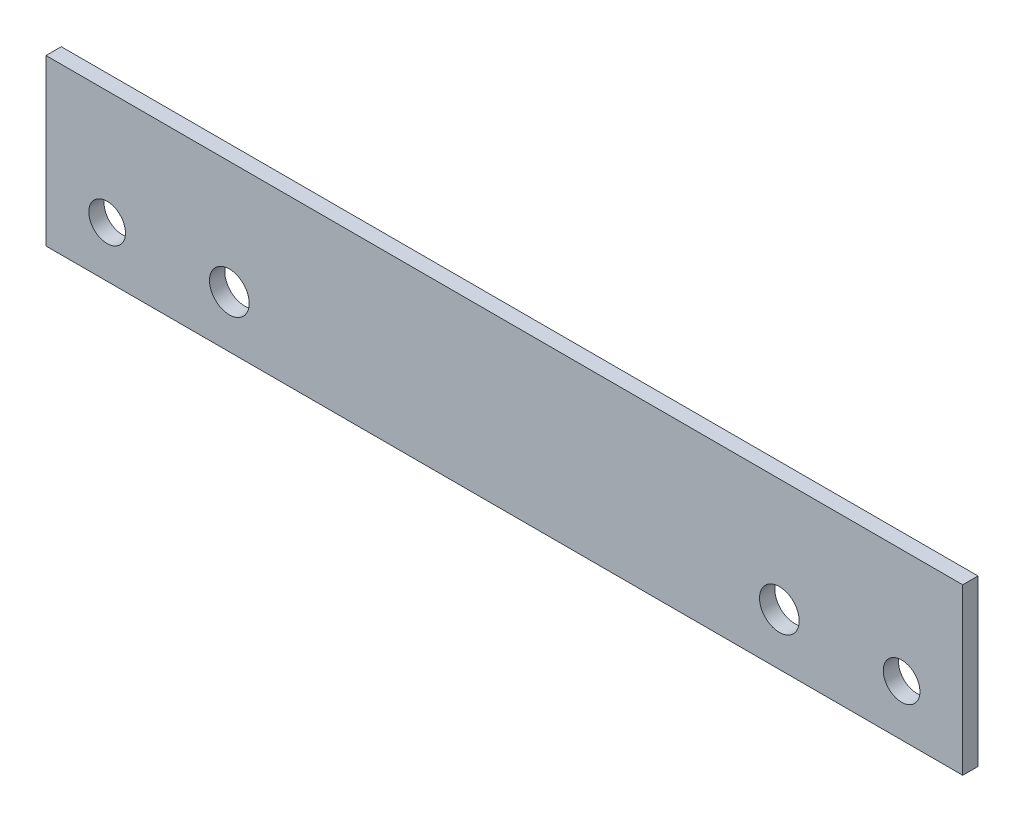
ISO-10303-21;
HEADER;
FILE_DESCRIPTION(('STEP AP214'),'2;1');
FILE_NAME('part.step','',(''),(''),'','','');
FILE_SCHEMA(('AUTOMOTIVE_DESIGN { 1 0 10303 214 1 1 1 1 }'));
ENDSEC;
DATA;
#1=APPLICATION_CONTEXT('core data for automotive mechanical design processes');
#2=APPLICATION_PROTOCOL_DEFINITION('international standard','automotive_design',2000,#1);
#3=PRODUCT_CONTEXT('',#1,'mechanical');
#4=PRODUCT('Part','Part','',(#3));
#5=PRODUCT_RELATED_PRODUCT_CATEGORY('part','',(#4));
#6=PRODUCT_DEFINITION_FORMATION('','',#4);
#7=PRODUCT_DEFINITION_CONTEXT('part definition',#1,'design');
#8=PRODUCT_DEFINITION('design','',#6,#7);
#9=PRODUCT_DEFINITION_SHAPE('','',#8);
#10=(LENGTH_UNIT() NAMED_UNIT(*) SI_UNIT(.MILLI.,.METRE.));
#11=(NAMED_UNIT(*) PLANE_ANGLE_UNIT() SI_UNIT($,.RADIAN.));
#12=(NAMED_UNIT(*) SI_UNIT($,.STERADIAN.) SOLID_ANGLE_UNIT());
#13=UNCERTAINTY_MEASURE_WITH_UNIT(LENGTH_MEASURE(1.E-05),#10,'distance_accuracy_value','');
#14=(GEOMETRIC_REPRESENTATION_CONTEXT(3) GLOBAL_UNCERTAINTY_ASSIGNED_CONTEXT((#13)) GLOBAL_UNIT_ASSIGNED_CONTEXT((#10,
#11,#12)) REPRESENTATION_CONTEXT('',''));
#15=CARTESIAN_POINT('',(0.,0.,0.));
#16=DIRECTION('',(0.,0.,1.));
#17=DIRECTION('',(1.,0.,0.));
#18=AXIS2_PLACEMENT_3D('',#15,#16,#17);
#19=CARTESIAN_POINT('',(150.,-27.,5.));
#20=DIRECTION('',(-1.,0.,0.));
#21=DIRECTION('',(0.,0.,1.));
#22=AXIS2_PLACEMENT_3D('',#19,#20,#21);
#23=PLANE('',#22);
#24=DIRECTION('',(0.,1.,0.));
#25=VECTOR('',#24,1.);
#26=CARTESIAN_POINT('',(150.,-27.,0.));
#27=LINE('',#26,#25);
#28=CARTESIAN_POINT('',(150.,-27.,0.));
#29=VERTEX_POINT('',#28);
#30=CARTESIAN_POINT('',(150.,27.,0.));
#31=VERTEX_POINT('',#30);
#32=EDGE_CURVE('E98',#29,#31,#27,.T.);
#33=ORIENTED_EDGE('',*,*,#32,.T.);
#34=DIRECTION('',(0.,0.,-1.));
#35=VECTOR('',#34,1.);
#36=CARTESIAN_POINT('',(150.,27.,5.));
#37=LINE('',#36,#35);
#38=CARTESIAN_POINT('',(150.,27.,5.));
#39=VERTEX_POINT('',#38);
#40=EDGE_CURVE('E11',#39,#31,#37,.T.);
#41=ORIENTED_EDGE('',*,*,#40,.F.);
#42=DIRECTION('',(0.,1.,0.));
#43=VECTOR('',#42,1.);
#44=CARTESIAN_POINT('',(150.,-27.,5.));
#45=LINE('',#44,#43);
#46=CARTESIAN_POINT('',(150.,-27.,5.));
#47=VERTEX_POINT('',#46);
#48=EDGE_CURVE('E86',#47,#39,#45,.T.);
#49=ORIENTED_EDGE('',*,*,#48,.F.);
#50=DIRECTION('',(0.,0.,-1.));
#51=VECTOR('',#50,1.);
#52=CARTESIAN_POINT('',(150.,-27.,5.));
#53=LINE('',#52,#51);
#54=EDGE_CURVE('E94',#47,#29,#53,.T.);
#55=ORIENTED_EDGE('',*,*,#54,.T.);
#56=EDGE_LOOP('',(#33,#41,#49,#55));
#57=FACE_BOUND('',#56,.T.);
#58=ADVANCED_FACE('F35',(#57),#23,.F.);
#59=CARTESIAN_POINT('',(-150.,27.,5.));
#60=DIRECTION('',(0.,-1.,0.));
#61=DIRECTION('',(0.,0.,-1.));
#62=AXIS2_PLACEMENT_3D('',#59,#60,#61);
#63=PLANE('',#62);
#64=DIRECTION('',(-1.,0.,0.));
#65=VECTOR('',#64,1.);
#66=CARTESIAN_POINT('',(-150.,27.,0.));
#67=LINE('',#66,#65);
#68=CARTESIAN_POINT('',(-150.,27.,0.));
#69=VERTEX_POINT('',#68);
#70=EDGE_CURVE('E90',#31,#69,#67,.T.);
#71=ORIENTED_EDGE('',*,*,#70,.T.);
#72=DIRECTION('',(0.,0.,-1.));
#73=VECTOR('',#72,1.);
#74=CARTESIAN_POINT('',(-150.,27.,5.));
#75=LINE('',#74,#73);
#76=CARTESIAN_POINT('',(-150.,27.,5.));
#77=VERTEX_POINT('',#76);
#78=EDGE_CURVE('E43',#77,#69,#75,.T.);
#79=ORIENTED_EDGE('',*,*,#78,.F.);
#80=DIRECTION('',(-1.,0.,0.));
#81=VECTOR('',#80,1.);
#82=CARTESIAN_POINT('',(-150.,27.,5.));
#83=LINE('',#82,#81);
#84=EDGE_CURVE('E81',#39,#77,#83,.T.);
#85=ORIENTED_EDGE('',*,*,#84,.F.);
#86=ORIENTED_EDGE('',*,*,#40,.T.);
#87=EDGE_LOOP('',(#71,#79,#85,#86));
#88=FACE_BOUND('',#87,.T.);
#89=ADVANCED_FACE('F89',(#88),#63,.F.);
#90=CARTESIAN_POINT('',(-150.,-27.,5.));
#91=DIRECTION('',(1.,0.,0.));
#92=DIRECTION('',(0.,0.,-1.));
#93=AXIS2_PLACEMENT_3D('',#90,#91,#92);
#94=PLANE('',#93);
#95=DIRECTION('',(0.,-1.,0.));
#96=VECTOR('',#95,1.);
#97=CARTESIAN_POINT('',(-150.,-27.,0.));
#98=LINE('',#97,#96);
#99=CARTESIAN_POINT('',(-150.,-27.,0.));
#100=VERTEX_POINT('',#99);
#101=EDGE_CURVE('E68',#69,#100,#98,.T.);
#102=ORIENTED_EDGE('',*,*,#101,.T.);
#103=DIRECTION('',(0.,0.,-1.));
#104=VECTOR('',#103,1.);
#105=CARTESIAN_POINT('',(-150.,-27.,5.));
#106=LINE('',#105,#104);
#107=CARTESIAN_POINT('',(-150.,-27.,5.));
#108=VERTEX_POINT('',#107);
#109=EDGE_CURVE('E91',#108,#100,#106,.T.);
#110=ORIENTED_EDGE('',*,*,#109,.F.);
#111=DIRECTION('',(0.,-1.,0.));
#112=VECTOR('',#111,1.);
#113=CARTESIAN_POINT('',(-150.,-27.,5.));
#114=LINE('',#113,#112);
#115=EDGE_CURVE('E84',#77,#108,#114,.T.);
#116=ORIENTED_EDGE('',*,*,#115,.F.);
#117=ORIENTED_EDGE('',*,*,#78,.T.);
#118=EDGE_LOOP('',(#102,#110,#116,#117));
#119=FACE_BOUND('',#118,.T.);
#120=ADVANCED_FACE('F92',(#119),#94,.F.);
#121=CARTESIAN_POINT('',(-150.,-27.,5.));
#122=DIRECTION('',(0.,1.,0.));
#123=DIRECTION('',(0.,0.,1.));
#124=AXIS2_PLACEMENT_3D('',#121,#122,#123);
#125=PLANE('',#124);
#126=DIRECTION('',(1.,0.,0.));
#127=VECTOR('',#126,1.);
#128=CARTESIAN_POINT('',(-150.,-27.,0.));
#129=LINE('',#128,#127);
#130=EDGE_CURVE('E74',#100,#29,#129,.T.);
#131=ORIENTED_EDGE('',*,*,#130,.T.);
#132=ORIENTED_EDGE('',*,*,#54,.F.);
#133=DIRECTION('',(1.,0.,0.));
#134=VECTOR('',#133,1.);
#135=CARTESIAN_POINT('',(-150.,-27.,5.));
#136=LINE('',#135,#134);
#137=EDGE_CURVE('E51',#108,#47,#136,.T.);
#138=ORIENTED_EDGE('',*,*,#137,.F.);
#139=ORIENTED_EDGE('',*,*,#109,.T.);
#140=EDGE_LOOP('',(#131,#132,#138,#139));
#141=FACE_BOUND('',#140,.T.);
#142=ADVANCED_FACE('F106',(#141),#125,.F.);
#143=CARTESIAN_POINT('',(0.,0.,5.));
#144=DIRECTION('',(0.,0.,-1.));
#145=DIRECTION('',(-1.,0.,0.));
#146=AXIS2_PLACEMENT_3D('',#143,#144,#145);
#147=PLANE('',#146);
#148=CARTESIAN_POINT('',(-90.,-10.,5.));
#149=DIRECTION('',(0.,0.,-1.));
#150=DIRECTION('',(-1.,0.,0.));
#151=AXIS2_PLACEMENT_3D('',#148,#149,#150);
#152=CIRCLE('',#151,6.5);
#153=CARTESIAN_POINT('',(-96.5,-10.,5.));
#154=VERTEX_POINT('',#153);
#155=EDGE_CURVE('E129',#154,#154,#152,.F.);
#156=ORIENTED_EDGE('',*,*,#155,.F.);
#157=EDGE_LOOP('',(#156));
#158=FACE_BOUND('',#157,.T.);
#159=CARTESIAN_POINT('',(90.,-10.,5.));
#160=DIRECTION('',(0.,0.,-1.));
#161=DIRECTION('',(-1.,0.,0.));
#162=AXIS2_PLACEMENT_3D('',#159,#160,#161);
#163=CIRCLE('',#162,6.5);
#164=CARTESIAN_POINT('',(83.5,-10.,5.));
#165=VERTEX_POINT('',#164);
#166=EDGE_CURVE('E121',#165,#165,#163,.T.);
#167=ORIENTED_EDGE('',*,*,#166,.T.);
#168=EDGE_LOOP('',(#167));
#169=FACE_BOUND('',#168,.T.);
#170=CARTESIAN_POINT('',(-130.,-10.3,5.));
#171=DIRECTION('',(0.,0.,1.));
#172=DIRECTION('',(1.,0.,0.));
#173=AXIS2_PLACEMENT_3D('',#170,#171,#172);
#174=CIRCLE('',#173,6.);
#175=CARTESIAN_POINT('',(-124.,-10.3,5.));
#176=VERTEX_POINT('',#175);
#177=EDGE_CURVE('E115',#176,#176,#174,.T.);
#178=ORIENTED_EDGE('',*,*,#177,.F.);
#179=EDGE_LOOP('',(#178));
#180=FACE_BOUND('',#179,.T.);
#181=CARTESIAN_POINT('',(130.,-10.3,5.));
#182=DIRECTION('',(0.,0.,-1.));
#183=DIRECTION('',(-1.,0.,0.));
#184=AXIS2_PLACEMENT_3D('',#181,#182,#183);
#185=CIRCLE('',#184,6.);
#186=CARTESIAN_POINT('',(124.,-10.3,5.));
#187=VERTEX_POINT('',#186);
#188=EDGE_CURVE('E101',#187,#187,#185,.T.);
#189=ORIENTED_EDGE('',*,*,#188,.T.);
#190=EDGE_LOOP('',(#189));
#191=FACE_BOUND('',#190,.T.);
#192=ORIENTED_EDGE('',*,*,#48,.T.);
#193=ORIENTED_EDGE('',*,*,#84,.T.);
#194=ORIENTED_EDGE('',*,*,#115,.T.);
#195=ORIENTED_EDGE('',*,*,#137,.T.);
#196=EDGE_LOOP('',(#192,#193,#194,#195));
#197=FACE_BOUND('',#196,.T.);
#198=ADVANCED_FACE('F82',(#158,#169,#180,#191,#197),#147,.F.);
#199=CARTESIAN_POINT('',(0.,0.,0.));
#200=DIRECTION('',(0.,0.,-1.));
#201=DIRECTION('',(-1.,0.,0.));
#202=AXIS2_PLACEMENT_3D('',#199,#200,#201);
#203=PLANE('',#202);
#204=CARTESIAN_POINT('',(-90.,-10.,0.));
#205=DIRECTION('',(0.,0.,1.));
#206=DIRECTION('',(1.,0.,0.));
#207=AXIS2_PLACEMENT_3D('',#204,#205,#206);
#208=CIRCLE('',#207,6.5);
#209=CARTESIAN_POINT('',(-83.5,-10.,0.));
#210=VERTEX_POINT('',#209);
#211=EDGE_CURVE('E132',#210,#210,#208,.T.);
#212=ORIENTED_EDGE('',*,*,#211,.T.);
#213=EDGE_LOOP('',(#212));
#214=FACE_BOUND('',#213,.T.);
#215=CARTESIAN_POINT('',(90.,-10.,0.));
#216=DIRECTION('',(0.,0.,-1.));
#217=DIRECTION('',(-1.,0.,0.));
#218=AXIS2_PLACEMENT_3D('',#215,#216,#217);
#219=CIRCLE('',#218,6.5);
#220=CARTESIAN_POINT('',(83.5,-10.,0.));
#221=VERTEX_POINT('',#220);
#222=EDGE_CURVE('E126',#221,#221,#219,.T.);
#223=ORIENTED_EDGE('',*,*,#222,.F.);
#224=EDGE_LOOP('',(#223));
#225=FACE_BOUND('',#224,.T.);
#226=CARTESIAN_POINT('',(-130.,-10.3,0.));
#227=DIRECTION('',(0.,0.,1.));
#228=DIRECTION('',(1.,0.,0.));
#229=AXIS2_PLACEMENT_3D('',#226,#227,#228);
#230=CIRCLE('',#229,6.);
#231=CARTESIAN_POINT('',(-124.,-10.3,0.));
#232=VERTEX_POINT('',#231);
#233=EDGE_CURVE('E118',#232,#232,#230,.T.);
#234=ORIENTED_EDGE('',*,*,#233,.T.);
#235=EDGE_LOOP('',(#234));
#236=FACE_BOUND('',#235,.T.);
#237=CARTESIAN_POINT('',(130.,-10.3,0.));
#238=DIRECTION('',(0.,0.,-1.));
#239=DIRECTION('',(-1.,0.,0.));
#240=AXIS2_PLACEMENT_3D('',#237,#238,#239);
#241=CIRCLE('',#240,6.);
#242=CARTESIAN_POINT('',(124.,-10.3,0.));
#243=VERTEX_POINT('',#242);
#244=EDGE_CURVE('E112',#243,#243,#241,.T.);
#245=ORIENTED_EDGE('',*,*,#244,.F.);
#246=EDGE_LOOP('',(#245));
#247=FACE_BOUND('',#246,.T.);
#248=ORIENTED_EDGE('',*,*,#32,.F.);
#249=ORIENTED_EDGE('',*,*,#130,.F.);
#250=ORIENTED_EDGE('',*,*,#101,.F.);
#251=ORIENTED_EDGE('',*,*,#70,.F.);
#252=EDGE_LOOP('',(#248,#249,#250,#251));
#253=FACE_BOUND('',#252,.T.);
#254=ADVANCED_FACE('F109',(#214,#225,#236,#247,#253),#203,.T.);
#255=CARTESIAN_POINT('',(130.,-10.3,5.));
#256=DIRECTION('',(0.,0.,-1.));
#257=DIRECTION('',(-1.,0.,0.));
#258=AXIS2_PLACEMENT_3D('',#255,#256,#257);
#259=CYLINDRICAL_SURFACE('',#258,6.);
#260=ORIENTED_EDGE('',*,*,#188,.F.);
#261=EDGE_LOOP('',(#260));
#262=FACE_BOUND('',#261,.T.);
#263=ORIENTED_EDGE('',*,*,#244,.T.);
#264=EDGE_LOOP('',(#263));
#265=FACE_BOUND('',#264,.T.);
#266=ADVANCED_FACE('F154',(#262,#265),#259,.F.);
#267=CARTESIAN_POINT('',(-130.,-10.3,5.));
#268=DIRECTION('',(0.,0.,-1.));
#269=DIRECTION('',(-1.,0.,0.));
#270=AXIS2_PLACEMENT_3D('',#267,#268,#269);
#271=CYLINDRICAL_SURFACE('',#270,6.);
#272=ORIENTED_EDGE('',*,*,#177,.T.);
#273=EDGE_LOOP('',(#272));
#274=FACE_BOUND('',#273,.T.);
#275=ORIENTED_EDGE('',*,*,#233,.F.);
#276=EDGE_LOOP('',(#275));
#277=FACE_BOUND('',#276,.T.);
#278=ADVANCED_FACE('F157',(#274,#277),#271,.F.);
#279=CARTESIAN_POINT('',(90.,-10.,10.));
#280=DIRECTION('',(0.,0.,-1.));
#281=DIRECTION('',(-1.,0.,0.));
#282=AXIS2_PLACEMENT_3D('',#279,#280,#281);
#283=CYLINDRICAL_SURFACE('',#282,6.5);
#284=ORIENTED_EDGE('',*,*,#222,.T.);
#285=EDGE_LOOP('',(#284));
#286=FACE_BOUND('',#285,.T.);
#287=ORIENTED_EDGE('',*,*,#166,.F.);
#288=EDGE_LOOP('',(#287));
#289=FACE_BOUND('',#288,.T.);
#290=ADVANCED_FACE('F141',(#286,#289),#283,.F.);
#291=CARTESIAN_POINT('',(-90.,-10.,10.));
#292=DIRECTION('',(0.,0.,-1.));
#293=DIRECTION('',(-1.,0.,0.));
#294=AXIS2_PLACEMENT_3D('',#291,#292,#293);
#295=CYLINDRICAL_SURFACE('',#294,6.5);
#296=ORIENTED_EDGE('',*,*,#211,.F.);
#297=EDGE_LOOP('',(#296));
#298=FACE_BOUND('',#297,.T.);
#299=ORIENTED_EDGE('',*,*,#155,.T.);
#300=EDGE_LOOP('',(#299));
#301=FACE_BOUND('',#300,.T.);
#302=ADVANCED_FACE('F138',(#298,#301),#295,.F.);
#303=CLOSED_SHELL('',(#58,#89,#120,#142,#198,#254,#266,#278,#290,#302));
#304=MANIFOLD_SOLID_BREP('B2',#303);
#305=ADVANCED_BREP_SHAPE_REPRESENTATION('',(#18,#304),#14);
#306=SHAPE_DEFINITION_REPRESENTATION(#9,#305);
ENDSEC;
END-ISO-10303-21;
